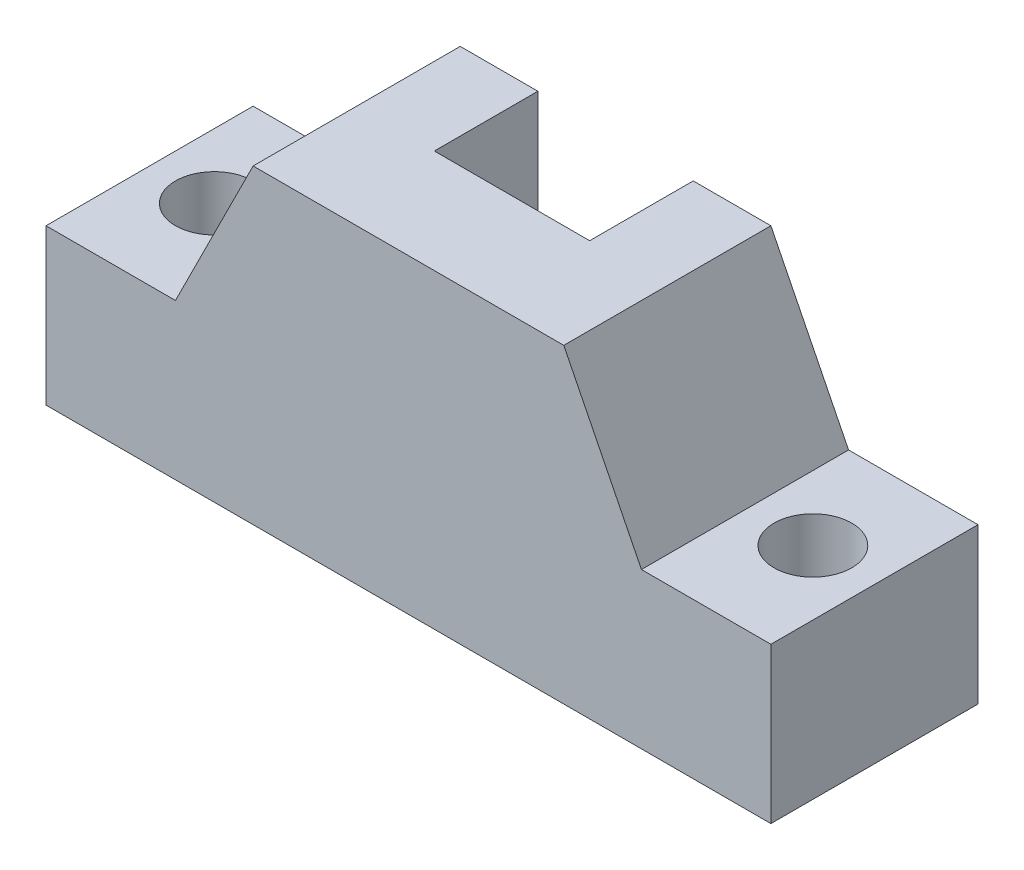
ISO-10303-21;
HEADER;
FILE_DESCRIPTION(('STEP AP214'),'2;1');
FILE_NAME('part.step','',(''),(''),'','','');
FILE_SCHEMA(('AUTOMOTIVE_DESIGN { 1 0 10303 214 1 1 1 1 }'));
ENDSEC;
DATA;
#1=APPLICATION_CONTEXT('core data for automotive mechanical design processes');
#2=APPLICATION_PROTOCOL_DEFINITION('international standard','automotive_design',2000,#1);
#3=PRODUCT_CONTEXT('',#1,'mechanical');
#4=PRODUCT('Part','Part','',(#3));
#5=PRODUCT_RELATED_PRODUCT_CATEGORY('part','',(#4));
#6=PRODUCT_DEFINITION_FORMATION('','',#4);
#7=PRODUCT_DEFINITION_CONTEXT('part definition',#1,'design');
#8=PRODUCT_DEFINITION('design','',#6,#7);
#9=PRODUCT_DEFINITION_SHAPE('','',#8);
#10=(LENGTH_UNIT() NAMED_UNIT(*) SI_UNIT(.MILLI.,.METRE.));
#11=(NAMED_UNIT(*) PLANE_ANGLE_UNIT() SI_UNIT($,.RADIAN.));
#12=(NAMED_UNIT(*) SI_UNIT($,.STERADIAN.) SOLID_ANGLE_UNIT());
#13=UNCERTAINTY_MEASURE_WITH_UNIT(LENGTH_MEASURE(1.E-05),#10,'distance_accuracy_value','');
#14=(GEOMETRIC_REPRESENTATION_CONTEXT(3) GLOBAL_UNCERTAINTY_ASSIGNED_CONTEXT((#13)) GLOBAL_UNIT_ASSIGNED_CONTEXT((#10,
#11,#12)) REPRESENTATION_CONTEXT('',''));
#15=CARTESIAN_POINT('',(0.,0.,0.));
#16=DIRECTION('',(0.,0.,1.));
#17=DIRECTION('',(1.,0.,0.));
#18=AXIS2_PLACEMENT_3D('',#15,#16,#17);
#19=CARTESIAN_POINT('',(40.,60.,40.));
#20=DIRECTION('',(0.,-1.,0.));
#21=DIRECTION('',(0.,0.,-1.));
#22=AXIS2_PLACEMENT_3D('',#19,#20,#21);
#23=PLANE('',#22);
#24=DIRECTION('',(0.,0.,1.));
#25=VECTOR('',#24,1.);
#26=CARTESIAN_POINT('',(85.,60.,0.));
#27=LINE('',#26,#25);
#28=CARTESIAN_POINT('',(85.,60.,0.));
#29=VERTEX_POINT('',#28);
#30=CARTESIAN_POINT('',(85.,60.,20.));
#31=VERTEX_POINT('',#30);
#32=EDGE_CURVE('E216',#29,#31,#27,.T.);
#33=ORIENTED_EDGE('',*,*,#32,.T.);
#34=DIRECTION('',(-1.,0.,0.));
#35=VECTOR('',#34,1.);
#36=CARTESIAN_POINT('',(85.,60.,20.));
#37=LINE('',#36,#35);
#38=CARTESIAN_POINT('',(55.,60.,20.));
#39=VERTEX_POINT('',#38);
#40=EDGE_CURVE('E208',#31,#39,#37,.T.);
#41=ORIENTED_EDGE('',*,*,#40,.T.);
#42=DIRECTION('',(0.,0.,1.));
#43=VECTOR('',#42,1.);
#44=CARTESIAN_POINT('',(55.,60.,0.));
#45=LINE('',#44,#43);
#46=CARTESIAN_POINT('',(55.,60.,0.));
#47=VERTEX_POINT('',#46);
#48=EDGE_CURVE('E222',#47,#39,#45,.T.);
#49=ORIENTED_EDGE('',*,*,#48,.F.);
#50=DIRECTION('',(-1.,0.,0.));
#51=VECTOR('',#50,1.);
#52=CARTESIAN_POINT('',(40.,60.,0.));
#53=LINE('',#52,#51);
#54=CARTESIAN_POINT('',(40.,60.,0.));
#55=VERTEX_POINT('',#54);
#56=EDGE_CURVE('E132',#47,#55,#53,.T.);
#57=ORIENTED_EDGE('',*,*,#56,.T.);
#58=DIRECTION('',(0.,0.,-1.));
#59=VECTOR('',#58,1.);
#60=CARTESIAN_POINT('',(40.,60.,40.));
#61=LINE('',#60,#59);
#62=CARTESIAN_POINT('',(40.,60.,40.));
#63=VERTEX_POINT('',#62);
#64=EDGE_CURVE('E128',#63,#55,#61,.T.);
#65=ORIENTED_EDGE('',*,*,#64,.F.);
#66=DIRECTION('',(-1.,0.,0.));
#67=VECTOR('',#66,1.);
#68=CARTESIAN_POINT('',(40.,60.,40.));
#69=LINE('',#68,#67);
#70=CARTESIAN_POINT('',(100.,60.,40.));
#71=VERTEX_POINT('',#70);
#72=EDGE_CURVE('E115',#71,#63,#69,.T.);
#73=ORIENTED_EDGE('',*,*,#72,.F.);
#74=DIRECTION('',(0.,0.,-1.));
#75=VECTOR('',#74,1.);
#76=CARTESIAN_POINT('',(100.,60.,40.));
#77=LINE('',#76,#75);
#78=CARTESIAN_POINT('',(100.,60.,0.));
#79=VERTEX_POINT('',#78);
#80=EDGE_CURVE('E135',#71,#79,#77,.T.);
#81=ORIENTED_EDGE('',*,*,#80,.T.);
#82=EDGE_CURVE('E156',#79,#29,#53,.T.);
#83=ORIENTED_EDGE('',*,*,#82,.T.);
#84=EDGE_LOOP('',(#33,#41,#49,#57,#65,#73,#81,#83));
#85=FACE_BOUND('',#84,.T.);
#86=ADVANCED_FACE('F35',(#85),#23,.F.);
#87=CARTESIAN_POINT('',(0.,0.,0.));
#88=DIRECTION('',(0.,0.,-1.));
#89=DIRECTION('',(-1.,0.,0.));
#90=AXIS2_PLACEMENT_3D('',#87,#88,#89);
#91=PLANE('',#90);
#92=DIRECTION('',(-1.,0.,0.));
#93=VECTOR('',#92,1.);
#94=CARTESIAN_POINT('',(85.,25.3589838486228,0.));
#95=LINE('',#94,#93);
#96=CARTESIAN_POINT('',(85.,25.3589838486228,0.));
#97=VERTEX_POINT('',#96);
#98=CARTESIAN_POINT('',(55.,25.3589838486228,0.));
#99=VERTEX_POINT('',#98);
#100=EDGE_CURVE('E211',#97,#99,#95,.T.);
#101=ORIENTED_EDGE('',*,*,#100,.F.);
#102=DIRECTION('',(0.,1.,0.));
#103=VECTOR('',#102,1.);
#104=CARTESIAN_POINT('',(85.,60.,0.));
#105=LINE('',#104,#103);
#106=EDGE_CURVE('E218',#97,#29,#105,.T.);
#107=ORIENTED_EDGE('',*,*,#106,.T.);
#108=ORIENTED_EDGE('',*,*,#82,.F.);
#109=DIRECTION('',(-0.447213595499958,0.894427190999916,0.));
#110=VECTOR('',#109,1.);
#111=CARTESIAN_POINT('',(100.,60.,0.));
#112=LINE('',#111,#110);
#113=CARTESIAN_POINT('',(115.,30.,0.));
#114=VERTEX_POINT('',#113);
#115=EDGE_CURVE('E154',#114,#79,#112,.T.);
#116=ORIENTED_EDGE('',*,*,#115,.F.);
#117=DIRECTION('',(-1.,0.,0.));
#118=VECTOR('',#117,1.);
#119=CARTESIAN_POINT('',(140.,30.,0.));
#120=LINE('',#119,#118);
#121=CARTESIAN_POINT('',(140.,30.,0.));
#122=VERTEX_POINT('',#121);
#123=EDGE_CURVE('E152',#122,#114,#120,.T.);
#124=ORIENTED_EDGE('',*,*,#123,.F.);
#125=DIRECTION('',(0.,1.,0.));
#126=VECTOR('',#125,1.);
#127=CARTESIAN_POINT('',(140.,0.,0.));
#128=LINE('',#127,#126);
#129=CARTESIAN_POINT('',(140.,0.,0.));
#130=VERTEX_POINT('',#129);
#131=EDGE_CURVE('E150',#130,#122,#128,.T.);
#132=ORIENTED_EDGE('',*,*,#131,.F.);
#133=DIRECTION('',(1.,0.,0.));
#134=VECTOR('',#133,1.);
#135=CARTESIAN_POINT('',(0.,0.,0.));
#136=LINE('',#135,#134);
#137=CARTESIAN_POINT('',(0.,0.,0.));
#138=VERTEX_POINT('',#137);
#139=EDGE_CURVE('E147',#138,#130,#136,.T.);
#140=ORIENTED_EDGE('',*,*,#139,.F.);
#141=DIRECTION('',(0.,-1.,0.));
#142=VECTOR('',#141,1.);
#143=CARTESIAN_POINT('',(0.,0.,0.));
#144=LINE('',#143,#142);
#145=CARTESIAN_POINT('',(0.,30.,0.));
#146=VERTEX_POINT('',#145);
#147=EDGE_CURVE('E144',#146,#138,#144,.T.);
#148=ORIENTED_EDGE('',*,*,#147,.F.);
#149=DIRECTION('',(-1.,0.,0.));
#150=VECTOR('',#149,1.);
#151=CARTESIAN_POINT('',(0.,30.,0.));
#152=LINE('',#151,#150);
#153=CARTESIAN_POINT('',(25.,30.,0.));
#154=VERTEX_POINT('',#153);
#155=EDGE_CURVE('E92',#154,#146,#152,.T.);
#156=ORIENTED_EDGE('',*,*,#155,.F.);
#157=DIRECTION('',(-0.447213595499958,-0.894427190999916,0.));
#158=VECTOR('',#157,1.);
#159=CARTESIAN_POINT('',(40.,60.,0.));
#160=LINE('',#159,#158);
#161=EDGE_CURVE('E159',#55,#154,#160,.T.);
#162=ORIENTED_EDGE('',*,*,#161,.F.);
#163=ORIENTED_EDGE('',*,*,#56,.F.);
#164=DIRECTION('',(0.,1.,0.));
#165=VECTOR('',#164,1.);
#166=CARTESIAN_POINT('',(55.,60.,0.));
#167=LINE('',#166,#165);
#168=EDGE_CURVE('E224',#99,#47,#167,.T.);
#169=ORIENTED_EDGE('',*,*,#168,.F.);
#170=EDGE_LOOP('',(#101,#107,#108,#116,#124,#132,#140,#148,#156,#162,#163,#169));
#171=FACE_BOUND('',#170,.T.);
#172=ADVANCED_FACE('F181',(#171),#91,.T.);
#173=CARTESIAN_POINT('',(0.,0.,40.));
#174=DIRECTION('',(1.,0.,0.));
#175=DIRECTION('',(0.,0.,-1.));
#176=AXIS2_PLACEMENT_3D('',#173,#174,#175);
#177=PLANE('',#176);
#178=ORIENTED_EDGE('',*,*,#147,.T.);
#179=DIRECTION('',(0.,0.,-1.));
#180=VECTOR('',#179,1.);
#181=CARTESIAN_POINT('',(0.,0.,40.));
#182=LINE('',#181,#180);
#183=CARTESIAN_POINT('',(0.,0.,40.));
#184=VERTEX_POINT('',#183);
#185=EDGE_CURVE('E11',#184,#138,#182,.T.);
#186=ORIENTED_EDGE('',*,*,#185,.F.);
#187=DIRECTION('',(0.,-1.,0.));
#188=VECTOR('',#187,1.);
#189=CARTESIAN_POINT('',(0.,0.,40.));
#190=LINE('',#189,#188);
#191=CARTESIAN_POINT('',(0.,30.,40.));
#192=VERTEX_POINT('',#191);
#193=EDGE_CURVE('E162',#192,#184,#190,.T.);
#194=ORIENTED_EDGE('',*,*,#193,.F.);
#195=DIRECTION('',(0.,0.,-1.));
#196=VECTOR('',#195,1.);
#197=CARTESIAN_POINT('',(0.,30.,40.));
#198=LINE('',#197,#196);
#199=EDGE_CURVE('E140',#192,#146,#198,.T.);
#200=ORIENTED_EDGE('',*,*,#199,.T.);
#201=EDGE_LOOP('',(#178,#186,#194,#200));
#202=FACE_BOUND('',#201,.T.);
#203=ADVANCED_FACE('F37',(#202),#177,.F.);
#204=CARTESIAN_POINT('',(0.,0.,40.));
#205=DIRECTION('',(0.,1.,0.));
#206=DIRECTION('',(0.,0.,1.));
#207=AXIS2_PLACEMENT_3D('',#204,#205,#206);
#208=PLANE('',#207);
#209=CARTESIAN_POINT('',(12.5,0.,20.));
#210=DIRECTION('',(0.,1.,0.));
#211=DIRECTION('',(0.,0.,1.));
#212=AXIS2_PLACEMENT_3D('',#209,#210,#211);
#213=CIRCLE('',#212,7.5);
#214=CARTESIAN_POINT('',(12.5,0.,27.5));
#215=VERTEX_POINT('',#214);
#216=EDGE_CURVE('E202',#215,#215,#213,.T.);
#217=ORIENTED_EDGE('',*,*,#216,.T.);
#218=EDGE_LOOP('',(#217));
#219=FACE_BOUND('',#218,.T.);
#220=CARTESIAN_POINT('',(127.532427410702,0.,19.4218803233071));
#221=DIRECTION('',(0.,1.,0.));
#222=DIRECTION('',(0.,0.,1.));
#223=AXIS2_PLACEMENT_3D('',#220,#221,#222);
#224=CIRCLE('',#223,7.50000000000001);
#225=CARTESIAN_POINT('',(127.532427410702,0.,26.9218803233071));
#226=VERTEX_POINT('',#225);
#227=EDGE_CURVE('E148',#226,#226,#224,.T.);
#228=ORIENTED_EDGE('',*,*,#227,.T.);
#229=EDGE_LOOP('',(#228));
#230=FACE_BOUND('',#229,.T.);
#231=ORIENTED_EDGE('',*,*,#139,.T.);
#232=DIRECTION('',(0.,0.,-1.));
#233=VECTOR('',#232,1.);
#234=CARTESIAN_POINT('',(140.,0.,40.));
#235=LINE('',#234,#233);
#236=CARTESIAN_POINT('',(140.,0.,40.));
#237=VERTEX_POINT('',#236);
#238=EDGE_CURVE('E43',#237,#130,#235,.T.);
#239=ORIENTED_EDGE('',*,*,#238,.F.);
#240=DIRECTION('',(1.,0.,0.));
#241=VECTOR('',#240,1.);
#242=CARTESIAN_POINT('',(0.,0.,40.));
#243=LINE('',#242,#241);
#244=EDGE_CURVE('E100',#184,#237,#243,.T.);
#245=ORIENTED_EDGE('',*,*,#244,.F.);
#246=ORIENTED_EDGE('',*,*,#185,.T.);
#247=EDGE_LOOP('',(#231,#239,#245,#246));
#248=FACE_BOUND('',#247,.T.);
#249=ADVANCED_FACE('F235',(#219,#230,#248),#208,.F.);
#250=CARTESIAN_POINT('',(140.,0.,40.));
#251=DIRECTION('',(-1.,0.,0.));
#252=DIRECTION('',(0.,0.,1.));
#253=AXIS2_PLACEMENT_3D('',#250,#251,#252);
#254=PLANE('',#253);
#255=ORIENTED_EDGE('',*,*,#131,.T.);
#256=DIRECTION('',(0.,0.,-1.));
#257=VECTOR('',#256,1.);
#258=CARTESIAN_POINT('',(140.,30.,40.));
#259=LINE('',#258,#257);
#260=CARTESIAN_POINT('',(140.,30.,40.));
#261=VERTEX_POINT('',#260);
#262=EDGE_CURVE('E169',#261,#122,#259,.T.);
#263=ORIENTED_EDGE('',*,*,#262,.F.);
#264=DIRECTION('',(0.,1.,0.));
#265=VECTOR('',#264,1.);
#266=CARTESIAN_POINT('',(140.,0.,40.));
#267=LINE('',#266,#265);
#268=EDGE_CURVE('E177',#237,#261,#267,.T.);
#269=ORIENTED_EDGE('',*,*,#268,.F.);
#270=ORIENTED_EDGE('',*,*,#238,.T.);
#271=EDGE_LOOP('',(#255,#263,#269,#270));
#272=FACE_BOUND('',#271,.T.);
#273=ADVANCED_FACE('F175',(#272),#254,.F.);
#274=CARTESIAN_POINT('',(140.,30.,40.));
#275=DIRECTION('',(0.,-1.,0.));
#276=DIRECTION('',(0.,0.,-1.));
#277=AXIS2_PLACEMENT_3D('',#274,#275,#276);
#278=PLANE('',#277);
#279=CARTESIAN_POINT('',(127.532427410702,30.,19.4218803233071));
#280=DIRECTION('',(0.,1.,0.));
#281=DIRECTION('',(0.,0.,1.));
#282=AXIS2_PLACEMENT_3D('',#279,#280,#281);
#283=CIRCLE('',#282,7.50000000000001);
#284=CARTESIAN_POINT('',(127.532427410702,30.,26.9218803233071));
#285=VERTEX_POINT('',#284);
#286=EDGE_CURVE('E199',#285,#285,#283,.T.);
#287=ORIENTED_EDGE('',*,*,#286,.F.);
#288=EDGE_LOOP('',(#287));
#289=FACE_BOUND('',#288,.T.);
#290=ORIENTED_EDGE('',*,*,#123,.T.);
#291=DIRECTION('',(0.,0.,-1.));
#292=VECTOR('',#291,1.);
#293=CARTESIAN_POINT('',(115.,30.,40.));
#294=LINE('',#293,#292);
#295=CARTESIAN_POINT('',(115.,30.,40.));
#296=VERTEX_POINT('',#295);
#297=EDGE_CURVE('E166',#296,#114,#294,.T.);
#298=ORIENTED_EDGE('',*,*,#297,.F.);
#299=DIRECTION('',(-1.,0.,0.));
#300=VECTOR('',#299,1.);
#301=CARTESIAN_POINT('',(140.,30.,40.));
#302=LINE('',#301,#300);
#303=EDGE_CURVE('E191',#261,#296,#302,.T.);
#304=ORIENTED_EDGE('',*,*,#303,.F.);
#305=ORIENTED_EDGE('',*,*,#262,.T.);
#306=EDGE_LOOP('',(#290,#298,#304,#305));
#307=FACE_BOUND('',#306,.T.);
#308=ADVANCED_FACE('F187',(#289,#307),#278,.F.);
#309=CARTESIAN_POINT('',(100.,60.,40.));
#310=DIRECTION('',(-0.894427190999916,-0.447213595499958,0.));
#311=DIRECTION('',(0.447213595499958,-0.894427190999916,0.));
#312=AXIS2_PLACEMENT_3D('',#309,#310,#311);
#313=PLANE('',#312);
#314=ORIENTED_EDGE('',*,*,#115,.T.);
#315=ORIENTED_EDGE('',*,*,#80,.F.);
#316=DIRECTION('',(-0.447213595499958,0.894427190999916,0.));
#317=VECTOR('',#316,1.);
#318=CARTESIAN_POINT('',(100.,60.,40.));
#319=LINE('',#318,#317);
#320=EDGE_CURVE('E122',#296,#71,#319,.T.);
#321=ORIENTED_EDGE('',*,*,#320,.F.);
#322=ORIENTED_EDGE('',*,*,#297,.T.);
#323=EDGE_LOOP('',(#314,#315,#321,#322));
#324=FACE_BOUND('',#323,.T.);
#325=ADVANCED_FACE('F190',(#324),#313,.F.);
#326=CARTESIAN_POINT('',(40.,60.,40.));
#327=DIRECTION('',(0.894427190999916,-0.447213595499958,0.));
#328=DIRECTION('',(0.447213595499958,0.894427190999916,0.));
#329=AXIS2_PLACEMENT_3D('',#326,#327,#328);
#330=PLANE('',#329);
#331=ORIENTED_EDGE('',*,*,#161,.T.);
#332=DIRECTION('',(0.,0.,-1.));
#333=VECTOR('',#332,1.);
#334=CARTESIAN_POINT('',(25.,30.,40.));
#335=LINE('',#334,#333);
#336=CARTESIAN_POINT('',(25.,30.,40.));
#337=VERTEX_POINT('',#336);
#338=EDGE_CURVE('E136',#337,#154,#335,.T.);
#339=ORIENTED_EDGE('',*,*,#338,.F.);
#340=DIRECTION('',(-0.447213595499958,-0.894427190999916,0.));
#341=VECTOR('',#340,1.);
#342=CARTESIAN_POINT('',(40.,60.,40.));
#343=LINE('',#342,#341);
#344=EDGE_CURVE('E119',#63,#337,#343,.T.);
#345=ORIENTED_EDGE('',*,*,#344,.F.);
#346=ORIENTED_EDGE('',*,*,#64,.T.);
#347=EDGE_LOOP('',(#331,#339,#345,#346));
#348=FACE_BOUND('',#347,.T.);
#349=ADVANCED_FACE('F138',(#348),#330,.F.);
#350=CARTESIAN_POINT('',(0.,30.,40.));
#351=DIRECTION('',(0.,-1.,0.));
#352=DIRECTION('',(0.,0.,-1.));
#353=AXIS2_PLACEMENT_3D('',#350,#351,#352);
#354=PLANE('',#353);
#355=CARTESIAN_POINT('',(12.5,30.,20.));
#356=DIRECTION('',(0.,1.,0.));
#357=DIRECTION('',(0.,0.,1.));
#358=AXIS2_PLACEMENT_3D('',#355,#356,#357);
#359=CIRCLE('',#358,7.5);
#360=CARTESIAN_POINT('',(12.5,30.,27.5));
#361=VERTEX_POINT('',#360);
#362=EDGE_CURVE('E205',#361,#361,#359,.T.);
#363=ORIENTED_EDGE('',*,*,#362,.F.);
#364=EDGE_LOOP('',(#363));
#365=FACE_BOUND('',#364,.T.);
#366=ORIENTED_EDGE('',*,*,#155,.T.);
#367=ORIENTED_EDGE('',*,*,#199,.F.);
#368=DIRECTION('',(-1.,0.,0.));
#369=VECTOR('',#368,1.);
#370=CARTESIAN_POINT('',(0.,30.,40.));
#371=LINE('',#370,#369);
#372=EDGE_CURVE('E59',#337,#192,#371,.T.);
#373=ORIENTED_EDGE('',*,*,#372,.F.);
#374=ORIENTED_EDGE('',*,*,#338,.T.);
#375=EDGE_LOOP('',(#366,#367,#373,#374));
#376=FACE_BOUND('',#375,.T.);
#377=ADVANCED_FACE('F231',(#365,#376),#354,.F.);
#378=CARTESIAN_POINT('',(0.,0.,40.));
#379=DIRECTION('',(0.,0.,-1.));
#380=DIRECTION('',(-1.,0.,0.));
#381=AXIS2_PLACEMENT_3D('',#378,#379,#380);
#382=PLANE('',#381);
#383=ORIENTED_EDGE('',*,*,#193,.T.);
#384=ORIENTED_EDGE('',*,*,#244,.T.);
#385=ORIENTED_EDGE('',*,*,#268,.T.);
#386=ORIENTED_EDGE('',*,*,#303,.T.);
#387=ORIENTED_EDGE('',*,*,#320,.T.);
#388=ORIENTED_EDGE('',*,*,#72,.T.);
#389=ORIENTED_EDGE('',*,*,#344,.T.);
#390=ORIENTED_EDGE('',*,*,#372,.T.);
#391=EDGE_LOOP('',(#383,#384,#385,#386,#387,#388,#389,#390));
#392=FACE_BOUND('',#391,.T.);
#393=ADVANCED_FACE('F117',(#392),#382,.F.);
#394=CARTESIAN_POINT('',(127.532427410702,-10.,19.4218803233071));
#395=DIRECTION('',(0.,1.,0.));
#396=DIRECTION('',(0.,0.,1.));
#397=AXIS2_PLACEMENT_3D('',#394,#395,#396);
#398=CYLINDRICAL_SURFACE('',#397,7.50000000000001);
#399=ORIENTED_EDGE('',*,*,#286,.T.);
#400=EDGE_LOOP('',(#399));
#401=FACE_BOUND('',#400,.T.);
#402=ORIENTED_EDGE('',*,*,#227,.F.);
#403=EDGE_LOOP('',(#402));
#404=FACE_BOUND('',#403,.T.);
#405=ADVANCED_FACE('F261',(#401,#404),#398,.F.);
#406=CARTESIAN_POINT('',(12.5,-10.,20.));
#407=DIRECTION('',(0.,1.,0.));
#408=DIRECTION('',(0.,0.,1.));
#409=AXIS2_PLACEMENT_3D('',#406,#407,#408);
#410=CYLINDRICAL_SURFACE('',#409,7.5);
#411=ORIENTED_EDGE('',*,*,#362,.T.);
#412=EDGE_LOOP('',(#411));
#413=FACE_BOUND('',#412,.T.);
#414=ORIENTED_EDGE('',*,*,#216,.F.);
#415=EDGE_LOOP('',(#414));
#416=FACE_BOUND('',#415,.T.);
#417=ADVANCED_FACE('F264',(#413,#416),#410,.F.);
#418=CARTESIAN_POINT('',(85.,60.,20.));
#419=DIRECTION('',(0.,0.500000000000004,-0.866025403784436));
#420=DIRECTION('',(0.,0.866025403784436,0.500000000000004));
#421=AXIS2_PLACEMENT_3D('',#418,#419,#420);
#422=PLANE('',#421);
#423=ORIENTED_EDGE('',*,*,#40,.F.);
#424=DIRECTION('',(0.,-0.866025403784436,-0.500000000000004));
#425=VECTOR('',#424,1.);
#426=CARTESIAN_POINT('',(85.,60.,20.));
#427=LINE('',#426,#425);
#428=EDGE_CURVE('E213',#31,#97,#427,.T.);
#429=ORIENTED_EDGE('',*,*,#428,.T.);
#430=ORIENTED_EDGE('',*,*,#100,.T.);
#431=DIRECTION('',(0.,-0.866025403784436,-0.500000000000004));
#432=VECTOR('',#431,1.);
#433=CARTESIAN_POINT('',(55.,60.,20.));
#434=LINE('',#433,#432);
#435=EDGE_CURVE('E50',#39,#99,#434,.T.);
#436=ORIENTED_EDGE('',*,*,#435,.F.);
#437=EDGE_LOOP('',(#423,#429,#430,#436));
#438=FACE_BOUND('',#437,.T.);
#439=ADVANCED_FACE('F271',(#438),#422,.T.);
#440=CARTESIAN_POINT('',(85.,0.,0.));
#441=DIRECTION('',(-1.,0.,0.));
#442=DIRECTION('',(0.,0.,1.));
#443=AXIS2_PLACEMENT_3D('',#440,#441,#442);
#444=PLANE('',#443);
#445=ORIENTED_EDGE('',*,*,#106,.F.);
#446=ORIENTED_EDGE('',*,*,#428,.F.);
#447=ORIENTED_EDGE('',*,*,#32,.F.);
#448=EDGE_LOOP('',(#445,#446,#447));
#449=FACE_BOUND('',#448,.T.);
#450=ADVANCED_FACE('F324',(#449),#444,.T.);
#451=CARTESIAN_POINT('',(55.,0.,0.));
#452=DIRECTION('',(-1.,0.,0.));
#453=DIRECTION('',(0.,0.,1.));
#454=AXIS2_PLACEMENT_3D('',#451,#452,#453);
#455=PLANE('',#454);
#456=ORIENTED_EDGE('',*,*,#168,.T.);
#457=ORIENTED_EDGE('',*,*,#48,.T.);
#458=ORIENTED_EDGE('',*,*,#435,.T.);
#459=EDGE_LOOP('',(#456,#457,#458));
#460=FACE_BOUND('',#459,.T.);
#461=ADVANCED_FACE('F227',(#460),#455,.F.);
#462=CLOSED_SHELL('',(#86,#172,#203,#249,#273,#308,#325,#349,#377,#393,#405,#417,#439,#450,#461));
#463=MANIFOLD_SOLID_BREP('B2',#462);
#464=ADVANCED_BREP_SHAPE_REPRESENTATION('',(#18,#463),#14);
#465=SHAPE_DEFINITION_REPRESENTATION(#9,#464);
ENDSEC;
END-ISO-10303-21;
